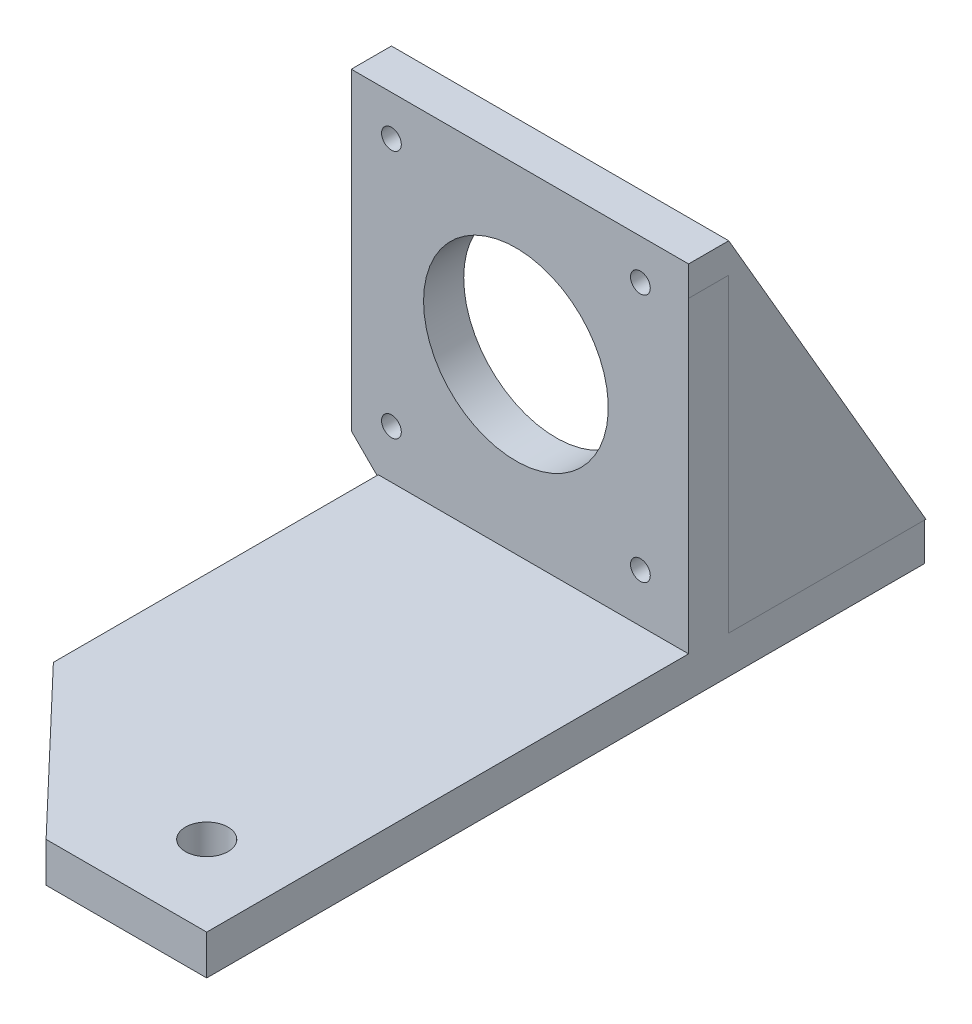
ISO-10303-21;
HEADER;
FILE_DESCRIPTION(('STEP AP214'),'2;1');
FILE_NAME('part.step','',(''),(''),'','','');
FILE_SCHEMA(('AUTOMOTIVE_DESIGN { 1 0 10303 214 1 1 1 1 }'));
ENDSEC;
DATA;
#1=APPLICATION_CONTEXT('core data for automotive mechanical design processes');
#2=APPLICATION_PROTOCOL_DEFINITION('international standard','automotive_design',2000,#1);
#3=PRODUCT_CONTEXT('',#1,'mechanical');
#4=PRODUCT('Part','Part','',(#3));
#5=PRODUCT_RELATED_PRODUCT_CATEGORY('part','',(#4));
#6=PRODUCT_DEFINITION_FORMATION('','',#4);
#7=PRODUCT_DEFINITION_CONTEXT('part definition',#1,'design');
#8=PRODUCT_DEFINITION('design','',#6,#7);
#9=PRODUCT_DEFINITION_SHAPE('','',#8);
#10=(LENGTH_UNIT() NAMED_UNIT(*) SI_UNIT(.MILLI.,.METRE.));
#11=(NAMED_UNIT(*) PLANE_ANGLE_UNIT() SI_UNIT($,.RADIAN.));
#12=(NAMED_UNIT(*) SI_UNIT($,.STERADIAN.) SOLID_ANGLE_UNIT());
#13=UNCERTAINTY_MEASURE_WITH_UNIT(LENGTH_MEASURE(1.E-05),#10,'distance_accuracy_value','');
#14=(GEOMETRIC_REPRESENTATION_CONTEXT(3) GLOBAL_UNCERTAINTY_ASSIGNED_CONTEXT((#13)) GLOBAL_UNIT_ASSIGNED_CONTEXT((#10,
#11,#12)) REPRESENTATION_CONTEXT('',''));
#15=CARTESIAN_POINT('',(0.,0.,0.));
#16=DIRECTION('',(0.,0.,1.));
#17=DIRECTION('',(1.,0.,0.));
#18=AXIS2_PLACEMENT_3D('',#15,#16,#17);
#19=CARTESIAN_POINT('',(148.500000052157,-128.194250021961,-39.4500000000031));
#20=DIRECTION('',(0.,0.,-1.));
#21=DIRECTION('',(0.,-1.,0.));
#22=AXIS2_PLACEMENT_3D('',#19,#20,#21);
#23=PLANE('',#22);
#24=CARTESIAN_POINT('',(133.000000052157,-143.694250021961,-39.4500000000037));
#25=DIRECTION('',(0.,0.,-1.));
#26=DIRECTION('',(-1.,0.,0.));
#27=AXIS2_PLACEMENT_3D('',#24,#25,#26);
#28=CIRCLE('',#27,1.23);
#29=CARTESIAN_POINT('',(134.230000052157,-143.694250021961,-39.4500000000037));
#30=VERTEX_POINT('',#29);
#31=EDGE_CURVE('E324',#30,#30,#28,.T.);
#32=ORIENTED_EDGE('',*,*,#31,.T.);
#33=EDGE_LOOP('',(#32));
#34=FACE_BOUND('',#33,.T.);
#35=CARTESIAN_POINT('',(133.000000052158,-112.694250021961,-39.4500000000036));
#36=DIRECTION('',(0.,0.,-1.));
#37=DIRECTION('',(-1.,0.,0.));
#38=AXIS2_PLACEMENT_3D('',#35,#36,#37);
#39=CIRCLE('',#38,1.23);
#40=CARTESIAN_POINT('',(134.230000052157,-112.694250021961,-39.4500000000035));
#41=VERTEX_POINT('',#40);
#42=EDGE_CURVE('E310',#41,#41,#39,.T.);
#43=ORIENTED_EDGE('',*,*,#42,.T.);
#44=EDGE_LOOP('',(#43));
#45=FACE_BOUND('',#44,.T.);
#46=CARTESIAN_POINT('',(164.000000052157,-143.694250021961,-39.4500000000027));
#47=DIRECTION('',(0.,0.,-1.));
#48=DIRECTION('',(-1.,0.,0.));
#49=AXIS2_PLACEMENT_3D('',#46,#47,#48);
#50=CIRCLE('',#49,1.23);
#51=CARTESIAN_POINT('',(165.230000052157,-143.694250021961,-39.4500000000027));
#52=VERTEX_POINT('',#51);
#53=EDGE_CURVE('E275',#52,#52,#50,.T.);
#54=ORIENTED_EDGE('',*,*,#53,.T.);
#55=EDGE_LOOP('',(#54));
#56=FACE_BOUND('',#55,.T.);
#57=CARTESIAN_POINT('',(164.000000052158,-112.694250021961,-39.4500000000026));
#58=DIRECTION('',(0.,0.,-1.));
#59=DIRECTION('',(-1.,0.,0.));
#60=AXIS2_PLACEMENT_3D('',#57,#58,#59);
#61=CIRCLE('',#60,1.23);
#62=CARTESIAN_POINT('',(165.230000052158,-112.694250021961,-39.4500000000025));
#63=VERTEX_POINT('',#62);
#64=EDGE_CURVE('E27',#63,#63,#61,.T.);
#65=ORIENTED_EDGE('',*,*,#64,.T.);
#66=EDGE_LOOP('',(#65));
#67=FACE_BOUND('',#66,.T.);
#68=CARTESIAN_POINT('',(148.500000052157,-128.194250021961,-39.4500000000031));
#69=DIRECTION('',(0.,0.,-1.));
#70=DIRECTION('',(1.,0.,0.));
#71=AXIS2_PLACEMENT_3D('',#68,#69,#70);
#72=CIRCLE('',#71,11.5);
#73=CARTESIAN_POINT('',(137.000000052157,-128.194250021961,-39.4500000000035));
#74=VERTEX_POINT('',#73);
#75=EDGE_CURVE('E355',#74,#74,#72,.T.);
#76=ORIENTED_EDGE('',*,*,#75,.T.);
#77=EDGE_LOOP('',(#76));
#78=FACE_BOUND('',#77,.T.);
#79=DIRECTION('',(1.,0.,0.));
#80=VECTOR('',#79,1.);
#81=CARTESIAN_POINT('',(159.250000052157,-149.744250021961,-39.4500000000029));
#82=LINE('',#81,#80);
#83=CARTESIAN_POINT('',(131.364748782072,-149.744250021961,-39.4500000000038));
#84=VERTEX_POINT('',#83);
#85=CARTESIAN_POINT('',(170.000000052158,-149.744250021961,-39.4500000000026));
#86=VERTEX_POINT('',#85);
#87=EDGE_CURVE('E400',#84,#86,#82,.T.);
#88=ORIENTED_EDGE('',*,*,#87,.T.);
#89=DIRECTION('',(0.,-1.,0.));
#90=VECTOR('',#89,1.);
#91=CARTESIAN_POINT('',(170.000000052157,-131.797822210261,-39.4500000000025));
#92=LINE('',#91,#90);
#93=CARTESIAN_POINT('',(170.000000052441,-111.40139439856,-39.4500000000023));
#94=VERTEX_POINT('',#93);
#95=EDGE_CURVE('E337',#94,#86,#92,.T.);
#96=ORIENTED_EDGE('',*,*,#95,.F.);
#97=DIRECTION('',(1.,0.,0.));
#98=VECTOR('',#97,1.);
#99=CARTESIAN_POINT('',(169.225256491919,-111.40139439856,-39.4500000000023));
#100=LINE('',#99,#98);
#101=CARTESIAN_POINT('',(170.000256491919,-111.40139439856,-39.4500000000023));
#102=VERTEX_POINT('',#101);
#103=EDGE_CURVE('E305',#94,#102,#100,.T.);
#104=ORIENTED_EDGE('',*,*,#103,.T.);
#105=DIRECTION('',(0.,-1.,0.));
#106=VECTOR('',#105,1.);
#107=CARTESIAN_POINT('',(170.000256491919,-118.928836768922,-39.4500000000024));
#108=LINE('',#107,#106);
#109=CARTESIAN_POINT('',(170.000256491919,-107.694249950324,-39.4500000000023));
#110=VERTEX_POINT('',#109);
#111=EDGE_CURVE('E304',#110,#102,#108,.T.);
#112=ORIENTED_EDGE('',*,*,#111,.F.);
#113=DIRECTION('',(1.,0.,0.));
#114=VECTOR('',#113,1.);
#115=CARTESIAN_POINT('',(131.529437303681,-107.694250021961,-39.4500000000036));
#116=LINE('',#115,#114);
#117=CARTESIAN_POINT('',(128.000000052069,-107.694249950324,-39.4500000000037));
#118=VERTEX_POINT('',#117);
#119=EDGE_CURVE('E11',#118,#110,#116,.T.);
#120=ORIENTED_EDGE('',*,*,#119,.F.);
#121=DIRECTION('',(0.,-1.,0.));
#122=VECTOR('',#121,1.);
#123=CARTESIAN_POINT('',(128.000000052157,-148.694250021961,-39.450000000004));
#124=LINE('',#123,#122);
#125=CARTESIAN_POINT('',(128.000000052157,-146.694250021961,-39.4500000000039));
#126=VERTEX_POINT('',#125);
#127=EDGE_CURVE('E232',#118,#126,#124,.T.);
#128=ORIENTED_EDGE('',*,*,#127,.T.);
#129=DIRECTION('',(-0.70710678117877,0.707106781194325,0.));
#130=VECTOR('',#129,1.);
#131=CARTESIAN_POINT('',(130.500000052001,-149.19425002186,-39.4500000000039));
#132=LINE('',#131,#130);
#133=CARTESIAN_POINT('',(131.364748782072,-150.05899875195,-39.4500000000038));
#134=VERTEX_POINT('',#133);
#135=EDGE_CURVE('E385',#134,#126,#132,.T.);
#136=ORIENTED_EDGE('',*,*,#135,.F.);
#137=DIRECTION('',(0.,1.,0.));
#138=VECTOR('',#137,1.);
#139=CARTESIAN_POINT('',(131.364748782072,-138.969250021961,-39.4500000000038));
#140=LINE('',#139,#138);
#141=EDGE_CURVE('E449',#134,#84,#140,.T.);
#142=ORIENTED_EDGE('',*,*,#141,.T.);
#143=EDGE_LOOP('',(#88,#96,#104,#112,#120,#128,#136,#142));
#144=FACE_BOUND('',#143,.T.);
#145=ADVANCED_FACE('F16',(#34,#45,#56,#67,#78,#144),#23,.F.);
#146=CARTESIAN_POINT('',(131.707144481147,-107.694250021961,-39.4500000000036));
#147=DIRECTION('',(0.,1.,0.));
#148=DIRECTION('',(0.,0.,-1.));
#149=AXIS2_PLACEMENT_3D('',#146,#147,#148);
#150=PLANE('',#149);
#151=ORIENTED_EDGE('',*,*,#119,.T.);
#152=DIRECTION('',(0.,0.,1.));
#153=VECTOR('',#152,1.);
#154=CARTESIAN_POINT('',(170.000256491919,-107.694249950324,-39.4500000000023));
#155=LINE('',#154,#153);
#156=CARTESIAN_POINT('',(170.000256491919,-107.694249950324,-44.4500000000023));
#157=VERTEX_POINT('',#156);
#158=EDGE_CURVE('E299',#157,#110,#155,.T.);
#159=ORIENTED_EDGE('',*,*,#158,.F.);
#160=DIRECTION('',(1.,0.,0.));
#161=VECTOR('',#160,1.);
#162=CARTESIAN_POINT('',(169.225256491919,-107.694249950324,-44.4500000000023));
#163=LINE('',#162,#161);
#164=CARTESIAN_POINT('',(166.000256491919,-107.694249950324,-44.4500000000024));
#165=VERTEX_POINT('',#164);
#166=EDGE_CURVE('E461',#165,#157,#163,.T.);
#167=ORIENTED_EDGE('',*,*,#166,.F.);
#168=DIRECTION('',(1.,0.,0.));
#169=VECTOR('',#168,1.);
#170=CARTESIAN_POINT('',(169.225256491919,-107.694249950324,-44.4500000000023));
#171=LINE('',#170,#169);
#172=CARTESIAN_POINT('',(128.00000005207,-107.694249950324,-44.4500000000037));
#173=VERTEX_POINT('',#172);
#174=EDGE_CURVE('E316',#173,#165,#171,.T.);
#175=ORIENTED_EDGE('',*,*,#174,.F.);
#176=DIRECTION('',(0.,0.,-1.));
#177=VECTOR('',#176,1.);
#178=CARTESIAN_POINT('',(128.000000052069,-107.694249950324,-39.4500000000037));
#179=LINE('',#178,#177);
#180=EDGE_CURVE('E527',#118,#173,#179,.T.);
#181=ORIENTED_EDGE('',*,*,#180,.F.);
#182=EDGE_LOOP('',(#151,#159,#167,#175,#181));
#183=FACE_BOUND('',#182,.T.);
#184=ADVANCED_FACE('F678',(#183),#150,.T.);
#185=CARTESIAN_POINT('',(164.000000052158,-112.694250021961,-39.4500000000026));
#186=DIRECTION('',(0.,0.,-1.));
#187=DIRECTION('',(-1.,0.,0.));
#188=AXIS2_PLACEMENT_3D('',#185,#186,#187);
#189=CYLINDRICAL_SURFACE('',#188,1.23);
#190=CARTESIAN_POINT('',(164.000000052158,-112.694250021961,-44.4500000000026));
#191=DIRECTION('',(0.,0.,1.));
#192=DIRECTION('',(-1.,0.,0.));
#193=AXIS2_PLACEMENT_3D('',#190,#191,#192);
#194=CIRCLE('',#193,1.23);
#195=CARTESIAN_POINT('',(165.230000052158,-112.694250021961,-44.4500000000025));
#196=VERTEX_POINT('',#195);
#197=EDGE_CURVE('E273',#196,#196,#194,.T.);
#198=ORIENTED_EDGE('',*,*,#197,.F.);
#199=DIRECTION('',(0.,0.,1.));
#200=VECTOR('',#199,1.);
#201=CARTESIAN_POINT('',(165.230000052158,-112.694250021961,-39.4500000000025));
#202=LINE('',#201,#200);
#203=EDGE_CURVE('E270',#196,#63,#202,.T.);
#204=ORIENTED_EDGE('',*,*,#203,.T.);
#205=ORIENTED_EDGE('',*,*,#64,.F.);
#206=ORIENTED_EDGE('',*,*,#203,.F.);
#207=EDGE_LOOP('',(#198,#204,#205,#206));
#208=FACE_BOUND('',#207,.T.);
#209=ADVANCED_FACE('F272',(#208),#189,.F.);
#210=CARTESIAN_POINT('',(164.000000052157,-143.694250021961,-39.4500000000027));
#211=DIRECTION('',(0.,0.,-1.));
#212=DIRECTION('',(-1.,0.,0.));
#213=AXIS2_PLACEMENT_3D('',#210,#211,#212);
#214=CYLINDRICAL_SURFACE('',#213,1.23);
#215=CARTESIAN_POINT('',(164.000000052157,-143.694250021961,-44.4500000000027));
#216=DIRECTION('',(0.,0.,1.));
#217=DIRECTION('',(-1.,0.,0.));
#218=AXIS2_PLACEMENT_3D('',#215,#216,#217);
#219=CIRCLE('',#218,1.23);
#220=CARTESIAN_POINT('',(165.230000052157,-143.694250021961,-44.4500000000027));
#221=VERTEX_POINT('',#220);
#222=EDGE_CURVE('E280',#221,#221,#219,.T.);
#223=ORIENTED_EDGE('',*,*,#222,.F.);
#224=DIRECTION('',(0.,0.,1.));
#225=VECTOR('',#224,1.);
#226=CARTESIAN_POINT('',(165.230000052157,-143.694250021961,-39.4500000000027));
#227=LINE('',#226,#225);
#228=EDGE_CURVE('E263',#221,#52,#227,.T.);
#229=ORIENTED_EDGE('',*,*,#228,.T.);
#230=ORIENTED_EDGE('',*,*,#53,.F.);
#231=ORIENTED_EDGE('',*,*,#228,.F.);
#232=EDGE_LOOP('',(#223,#229,#230,#231));
#233=FACE_BOUND('',#232,.T.);
#234=ADVANCED_FACE('F675',(#233),#214,.F.);
#235=CARTESIAN_POINT('',(133.000000052158,-112.694250021961,-39.4500000000036));
#236=DIRECTION('',(0.,0.,-1.));
#237=DIRECTION('',(-1.,0.,0.));
#238=AXIS2_PLACEMENT_3D('',#235,#236,#237);
#239=CYLINDRICAL_SURFACE('',#238,1.23);
#240=CARTESIAN_POINT('',(133.000000052158,-112.694250021961,-44.4500000000036));
#241=DIRECTION('',(0.,0.,1.));
#242=DIRECTION('',(-1.,0.,0.));
#243=AXIS2_PLACEMENT_3D('',#240,#241,#242);
#244=CIRCLE('',#243,1.23);
#245=CARTESIAN_POINT('',(134.230000052158,-112.694250021961,-44.4500000000035));
#246=VERTEX_POINT('',#245);
#247=EDGE_CURVE('E287',#246,#246,#244,.T.);
#248=ORIENTED_EDGE('',*,*,#247,.F.);
#249=DIRECTION('',(0.,0.,1.));
#250=VECTOR('',#249,1.);
#251=CARTESIAN_POINT('',(134.230000052157,-112.694250021961,-39.4500000000035));
#252=LINE('',#251,#250);
#253=EDGE_CURVE('E313',#246,#41,#252,.T.);
#254=ORIENTED_EDGE('',*,*,#253,.T.);
#255=ORIENTED_EDGE('',*,*,#42,.F.);
#256=ORIENTED_EDGE('',*,*,#253,.F.);
#257=EDGE_LOOP('',(#248,#254,#255,#256));
#258=FACE_BOUND('',#257,.T.);
#259=ADVANCED_FACE('F18',(#258),#239,.F.);
#260=CARTESIAN_POINT('',(133.000000052157,-143.694250021961,-39.4500000000037));
#261=DIRECTION('',(0.,0.,-1.));
#262=DIRECTION('',(-1.,0.,0.));
#263=AXIS2_PLACEMENT_3D('',#260,#261,#262);
#264=CYLINDRICAL_SURFACE('',#263,1.23);
#265=CARTESIAN_POINT('',(133.000000052157,-143.694250021961,-44.4500000000037));
#266=DIRECTION('',(0.,0.,1.));
#267=DIRECTION('',(-1.,0.,0.));
#268=AXIS2_PLACEMENT_3D('',#265,#266,#267);
#269=CIRCLE('',#268,1.23);
#270=CARTESIAN_POINT('',(134.230000052157,-143.694250021961,-44.4500000000037));
#271=VERTEX_POINT('',#270);
#272=EDGE_CURVE('E474',#271,#271,#269,.T.);
#273=ORIENTED_EDGE('',*,*,#272,.F.);
#274=DIRECTION('',(0.,0.,1.));
#275=VECTOR('',#274,1.);
#276=CARTESIAN_POINT('',(134.230000052157,-143.694250021961,-39.4500000000037));
#277=LINE('',#276,#275);
#278=EDGE_CURVE('E303',#271,#30,#277,.T.);
#279=ORIENTED_EDGE('',*,*,#278,.T.);
#280=ORIENTED_EDGE('',*,*,#31,.F.);
#281=ORIENTED_EDGE('',*,*,#278,.F.);
#282=EDGE_LOOP('',(#273,#279,#280,#281));
#283=FACE_BOUND('',#282,.T.);
#284=ADVANCED_FACE('F666',(#283),#264,.F.);
#285=CARTESIAN_POINT('',(170.000256491919,-107.694249950324,-39.4500000000023));
#286=DIRECTION('',(1.,0.,0.));
#287=DIRECTION('',(0.,0.,1.));
#288=AXIS2_PLACEMENT_3D('',#285,#286,#287);
#289=PLANE('',#288);
#290=ORIENTED_EDGE('',*,*,#111,.T.);
#291=DIRECTION('',(0.,0.,-1.));
#292=VECTOR('',#291,1.);
#293=CARTESIAN_POINT('',(170.000256491919,-111.40139439856,-41.9500000000023));
#294=LINE('',#293,#292);
#295=CARTESIAN_POINT('',(170.000256491919,-111.40139439856,-44.4500000000023));
#296=VERTEX_POINT('',#295);
#297=EDGE_CURVE('E309',#102,#296,#294,.T.);
#298=ORIENTED_EDGE('',*,*,#297,.T.);
#299=DIRECTION('',(0.,1.,0.));
#300=VECTOR('',#299,1.);
#301=CARTESIAN_POINT('',(170.000256491919,-150.000002235174,-44.4500000000023));
#302=LINE('',#301,#300);
#303=CARTESIAN_POINT('',(170.000256491919,-150.000002235174,-44.4500000000023));
#304=VERTEX_POINT('',#303);
#305=EDGE_CURVE('E345',#304,#296,#302,.T.);
#306=ORIENTED_EDGE('',*,*,#305,.F.);
#307=DIRECTION('',(0.,0.,1.));
#308=VECTOR('',#307,1.);
#309=CARTESIAN_POINT('',(170.00025649192,-150.000002235174,-69.0000013261975));
#310=LINE('',#309,#308);
#311=CARTESIAN_POINT('',(170.00025649192,-150.000002235174,-69.0000013261975));
#312=VERTEX_POINT('',#311);
#313=EDGE_CURVE('E429',#312,#304,#310,.T.);
#314=ORIENTED_EDGE('',*,*,#313,.F.);
#315=DIRECTION('',(0.,-0.864918791797365,-0.501911828507545));
#316=VECTOR('',#315,1.);
#317=CARTESIAN_POINT('',(170.000256491919,-107.694249950324,-44.4500000000023));
#318=LINE('',#317,#316);
#319=EDGE_CURVE('E456',#157,#312,#318,.T.);
#320=ORIENTED_EDGE('',*,*,#319,.F.);
#321=ORIENTED_EDGE('',*,*,#158,.T.);
#322=EDGE_LOOP('',(#290,#298,#306,#314,#320,#321));
#323=FACE_BOUND('',#322,.T.);
#324=ADVANCED_FACE('F637',(#323),#289,.T.);
#325=CARTESIAN_POINT('',(169.225256491919,-111.40139439856,-39.4500000000023));
#326=DIRECTION('',(0.,-1.,0.));
#327=DIRECTION('',(0.,0.,-1.));
#328=AXIS2_PLACEMENT_3D('',#325,#326,#327);
#329=PLANE('',#328);
#330=DIRECTION('',(0.,0.,1.));
#331=VECTOR('',#330,1.);
#332=CARTESIAN_POINT('',(170.000000052441,-111.40139439856,-39.4500000000023));
#333=LINE('',#332,#331);
#334=CARTESIAN_POINT('',(170.000000052441,-111.40139439856,-44.4500000000023));
#335=VERTEX_POINT('',#334);
#336=EDGE_CURVE('E341',#335,#94,#333,.T.);
#337=ORIENTED_EDGE('',*,*,#336,.F.);
#338=DIRECTION('',(1.,0.,0.));
#339=VECTOR('',#338,1.);
#340=CARTESIAN_POINT('',(169.225256491919,-111.40139439856,-44.4500000000023));
#341=LINE('',#340,#339);
#342=EDGE_CURVE('E298',#335,#296,#341,.T.);
#343=ORIENTED_EDGE('',*,*,#342,.T.);
#344=ORIENTED_EDGE('',*,*,#297,.F.);
#345=ORIENTED_EDGE('',*,*,#103,.F.);
#346=EDGE_LOOP('',(#337,#343,#344,#345));
#347=FACE_BOUND('',#346,.T.);
#348=ADVANCED_FACE('F632',(#347),#329,.T.);
#349=CARTESIAN_POINT('',(160.000000052158,-149.694250021961,-54.4500000000026));
#350=DIRECTION('',(0.,-1.,0.));
#351=DIRECTION('',(-1.,0.,0.));
#352=AXIS2_PLACEMENT_3D('',#349,#350,#351);
#353=CYLINDRICAL_SURFACE('',#352,2.65);
#354=CARTESIAN_POINT('',(160.000000052158,-149.894250021961,-54.4500000000026));
#355=DIRECTION('',(0.,1.,0.));
#356=DIRECTION('',(-1.,0.,0.));
#357=AXIS2_PLACEMENT_3D('',#354,#355,#356);
#358=CIRCLE('',#357,2.65);
#359=CARTESIAN_POINT('',(162.650000052158,-149.894250021961,-54.4500000000026));
#360=VERTEX_POINT('',#359);
#361=EDGE_CURVE('E325',#360,#360,#358,.T.);
#362=ORIENTED_EDGE('',*,*,#361,.T.);
#363=DIRECTION('',(0.,-1.,0.));
#364=VECTOR('',#363,1.);
#365=CARTESIAN_POINT('',(162.650000052158,-149.694250021961,-54.4500000000026));
#366=LINE('',#365,#364);
#367=CARTESIAN_POINT('',(162.650000052158,-154.694250021961,-54.4500000000026));
#368=VERTEX_POINT('',#367);
#369=EDGE_CURVE('E426',#360,#368,#366,.T.);
#370=ORIENTED_EDGE('',*,*,#369,.T.);
#371=CARTESIAN_POINT('',(160.000000052158,-154.694250021961,-54.4500000000026));
#372=DIRECTION('',(0.,1.,0.));
#373=DIRECTION('',(-1.,0.,0.));
#374=AXIS2_PLACEMENT_3D('',#371,#372,#373);
#375=CIRCLE('',#374,2.65);
#376=EDGE_CURVE('E482',#368,#368,#375,.T.);
#377=ORIENTED_EDGE('',*,*,#376,.F.);
#378=ORIENTED_EDGE('',*,*,#369,.F.);
#379=EDGE_LOOP('',(#362,#370,#377,#378));
#380=FACE_BOUND('',#379,.T.);
#381=ADVANCED_FACE('F897',(#380),#353,.F.);
#382=CARTESIAN_POINT('',(170.00025649192,-150.000002235174,-69.0000013261975));
#383=DIRECTION('',(0.,-1.,0.));
#384=DIRECTION('',(0.,0.,-1.));
#385=AXIS2_PLACEMENT_3D('',#382,#383,#384);
#386=PLANE('',#385);
#387=DIRECTION('',(0.,0.,1.));
#388=VECTOR('',#387,1.);
#389=CARTESIAN_POINT('',(170.000000052441,-150.000002235174,-54.2250006631001));
#390=LINE('',#389,#388);
#391=CARTESIAN_POINT('',(170.000000052442,-150.000002235174,-69.0000013261975));
#392=VERTEX_POINT('',#391);
#393=CARTESIAN_POINT('',(170.000000052442,-150.000002235174,-68.8225735100148));
#394=VERTEX_POINT('',#393);
#395=EDGE_CURVE('E331',#392,#394,#390,.T.);
#396=ORIENTED_EDGE('',*,*,#395,.F.);
#397=DIRECTION('',(-1.,0.,0.));
#398=VECTOR('',#397,1.);
#399=CARTESIAN_POINT('',(170.00025649192,-150.000002235174,-69.0000013261975));
#400=LINE('',#399,#398);
#401=EDGE_CURVE('E460',#312,#392,#400,.T.);
#402=ORIENTED_EDGE('',*,*,#401,.F.);
#403=ORIENTED_EDGE('',*,*,#313,.T.);
#404=DIRECTION('',(-1.,0.,0.));
#405=VECTOR('',#404,1.);
#406=CARTESIAN_POINT('',(170.000256491919,-150.000002235174,-44.4500000000023));
#407=LINE('',#406,#405);
#408=CARTESIAN_POINT('',(170.000000052441,-150.000002235174,-44.4500000000023));
#409=VERTEX_POINT('',#408);
#410=EDGE_CURVE('E342',#304,#409,#407,.T.);
#411=ORIENTED_EDGE('',*,*,#410,.T.);
#412=DIRECTION('',(0.,0.,1.));
#413=VECTOR('',#412,1.);
#414=CARTESIAN_POINT('',(170.000000052441,-150.000002235174,-54.2250006631001));
#415=LINE('',#414,#413);
#416=EDGE_CURVE('E450',#394,#409,#415,.T.);
#417=ORIENTED_EDGE('',*,*,#416,.F.);
#418=EDGE_LOOP('',(#396,#402,#403,#411,#417));
#419=FACE_BOUND('',#418,.T.);
#420=ADVANCED_FACE('F650',(#419),#386,.T.);
#421=CARTESIAN_POINT('',(170.000256491919,-107.694249950324,-44.4500000000023));
#422=DIRECTION('',(0.,0.501911828507545,-0.864918791797365));
#423=DIRECTION('',(-1.,0.,0.));
#424=AXIS2_PLACEMENT_3D('',#421,#422,#423);
#425=PLANE('',#424);
#426=DIRECTION('',(1.,0.,0.));
#427=VECTOR('',#426,1.);
#428=CARTESIAN_POINT('',(149.000128271951,-149.694250021961,-68.8225735100156));
#429=LINE('',#428,#427);
#430=CARTESIAN_POINT('',(166.00025649192,-149.694250021961,-68.822573510015));
#431=VERTEX_POINT('',#430);
#432=CARTESIAN_POINT('',(170.000000052158,-149.694250021961,-68.8225735100148));
#433=VERTEX_POINT('',#432);
#434=EDGE_CURVE('E502',#431,#433,#429,.T.);
#435=ORIENTED_EDGE('',*,*,#434,.F.);
#436=DIRECTION('',(0.,-0.864918791797365,-0.501911828507545));
#437=VECTOR('',#436,1.);
#438=CARTESIAN_POINT('',(166.000256491919,-107.694249950324,-44.4500000000024));
#439=LINE('',#438,#437);
#440=EDGE_CURVE('E295',#165,#431,#439,.T.);
#441=ORIENTED_EDGE('',*,*,#440,.F.);
#442=ORIENTED_EDGE('',*,*,#166,.T.);
#443=ORIENTED_EDGE('',*,*,#319,.T.);
#444=ORIENTED_EDGE('',*,*,#401,.T.);
#445=DIRECTION('',(0.,-0.864918791797365,-0.501911828507545));
#446=VECTOR('',#445,1.);
#447=CARTESIAN_POINT('',(170.000000052441,-107.99559620047,-44.6248710386004));
#448=LINE('',#447,#446);
#449=EDGE_CURVE('E336',#433,#392,#448,.T.);
#450=ORIENTED_EDGE('',*,*,#449,.F.);
#451=EDGE_LOOP('',(#435,#441,#442,#443,#444,#450));
#452=FACE_BOUND('',#451,.T.);
#453=ADVANCED_FACE('F916',(#452),#425,.T.);
#454=CARTESIAN_POINT('',(170.000256491919,-150.000002235174,-44.4500000000023));
#455=DIRECTION('',(0.,0.,1.));
#456=DIRECTION('',(1.,0.,0.));
#457=AXIS2_PLACEMENT_3D('',#454,#455,#456);
#458=PLANE('',#457);
#459=ORIENTED_EDGE('',*,*,#342,.F.);
#460=DIRECTION('',(0.,1.,0.));
#461=VECTOR('',#460,1.);
#462=CARTESIAN_POINT('',(170.000000052441,-130.700698316867,-44.4500000000023));
#463=LINE('',#462,#461);
#464=EDGE_CURVE('E454',#409,#335,#463,.T.);
#465=ORIENTED_EDGE('',*,*,#464,.F.);
#466=ORIENTED_EDGE('',*,*,#410,.F.);
#467=ORIENTED_EDGE('',*,*,#305,.T.);
#468=EDGE_LOOP('',(#459,#465,#466,#467));
#469=FACE_BOUND('',#468,.T.);
#470=ADVANCED_FACE('F643',(#469),#458,.T.);
#471=CARTESIAN_POINT('',(166.00025649192,-128.847126092749,-56.7250006631));
#472=DIRECTION('',(-1.,0.,0.));
#473=DIRECTION('',(0.,0.,1.));
#474=AXIS2_PLACEMENT_3D('',#471,#472,#473);
#475=PLANE('',#474);
#476=DIRECTION('',(0.,-1.,0.));
#477=VECTOR('',#476,1.);
#478=CARTESIAN_POINT('',(166.000256491919,-149.694250021961,-44.4500000000024));
#479=LINE('',#478,#477);
#480=CARTESIAN_POINT('',(166.000256491919,-149.894250021961,-44.4500000000024));
#481=VERTEX_POINT('',#480);
#482=EDGE_CURVE('E318',#165,#481,#479,.T.);
#483=ORIENTED_EDGE('',*,*,#482,.F.);
#484=ORIENTED_EDGE('',*,*,#440,.T.);
#485=DIRECTION('',(0.,-1.,0.));
#486=VECTOR('',#485,1.);
#487=CARTESIAN_POINT('',(166.00025649192,-149.694250021961,-68.822573510015));
#488=LINE('',#487,#486);
#489=CARTESIAN_POINT('',(166.00025649192,-149.894250021961,-68.822573510015));
#490=VERTEX_POINT('',#489);
#491=EDGE_CURVE('E414',#431,#490,#488,.T.);
#492=ORIENTED_EDGE('',*,*,#491,.T.);
#493=DIRECTION('',(0.,0.,1.));
#494=VECTOR('',#493,1.);
#495=CARTESIAN_POINT('',(166.000256491918,-149.894250021961,-16.5875003315514));
#496=LINE('',#495,#494);
#497=EDGE_CURVE('E330',#490,#481,#496,.T.);
#498=ORIENTED_EDGE('',*,*,#497,.T.);
#499=EDGE_LOOP('',(#483,#484,#492,#498));
#500=FACE_BOUND('',#499,.T.);
#501=ADVANCED_FACE('F911',(#500),#475,.T.);
#502=CARTESIAN_POINT('',(148.500000052158,-128.194250021961,-44.4500000000031));
#503=DIRECTION('',(0.,0.,1.));
#504=DIRECTION('',(1.,0.,0.));
#505=AXIS2_PLACEMENT_3D('',#502,#503,#504);
#506=CYLINDRICAL_SURFACE('',#505,11.5);
#507=ORIENTED_EDGE('',*,*,#75,.F.);
#508=DIRECTION('',(0.,0.,-1.));
#509=VECTOR('',#508,1.);
#510=CARTESIAN_POINT('',(137.000000052158,-128.194250021961,-44.4500000000035));
#511=LINE('',#510,#509);
#512=CARTESIAN_POINT('',(137.000000052158,-128.194250021961,-44.4500000000035));
#513=VERTEX_POINT('',#512);
#514=EDGE_CURVE('E293',#74,#513,#511,.T.);
#515=ORIENTED_EDGE('',*,*,#514,.T.);
#516=CARTESIAN_POINT('',(148.500000052158,-128.194250021961,-44.4500000000031));
#517=DIRECTION('',(0.,0.,1.));
#518=DIRECTION('',(1.,0.,0.));
#519=AXIS2_PLACEMENT_3D('',#516,#517,#518);
#520=CIRCLE('',#519,11.5);
#521=EDGE_CURVE('E492',#513,#513,#520,.T.);
#522=ORIENTED_EDGE('',*,*,#521,.F.);
#523=ORIENTED_EDGE('',*,*,#514,.F.);
#524=EDGE_LOOP('',(#507,#515,#522,#523));
#525=FACE_BOUND('',#524,.T.);
#526=ADVANCED_FACE('F685',(#525),#506,.F.);
#527=CARTESIAN_POINT('',(151.500001173424,-140.694250021961,-53.7250006184001));
#528=DIRECTION('',(0.,1.,0.));
#529=DIRECTION('',(0.,0.,-1.));
#530=AXIS2_PLACEMENT_3D('',#527,#528,#529);
#531=PLANE('',#530);
#532=DIRECTION('',(0.,0.,1.));
#533=VECTOR('',#532,1.);
#534=CARTESIAN_POINT('',(150.00000005207,-140.694250021961,-74.862500309202));
#535=LINE('',#534,#533);
#536=CARTESIAN_POINT('',(150.00000005207,-140.694250021961,-45.000001236797));
#537=VERTEX_POINT('',#536);
#538=CARTESIAN_POINT('',(150.00000005207,-140.694250021961,-44.4500000000032));
#539=VERTEX_POINT('',#538);
#540=EDGE_CURVE('E395',#537,#539,#535,.T.);
#541=ORIENTED_EDGE('',*,*,#540,.T.);
#542=DIRECTION('',(-1.,0.,0.));
#543=VECTOR('',#542,1.);
#544=CARTESIAN_POINT('',(150.000000612791,-140.694250021961,-44.4500000000032));
#545=LINE('',#544,#543);
#546=CARTESIAN_POINT('',(154.000002294779,-140.694250021961,-44.4500000000032));
#547=VERTEX_POINT('',#546);
#548=EDGE_CURVE('E185',#547,#539,#545,.T.);
#549=ORIENTED_EDGE('',*,*,#548,.F.);
#550=DIRECTION('',(0.,0.,-1.));
#551=VECTOR('',#550,1.);
#552=CARTESIAN_POINT('',(154.000002294779,-140.694250021961,-44.4500000000032));
#553=LINE('',#552,#551);
#554=CARTESIAN_POINT('',(154.000002294779,-140.694250021961,-45.000001236797));
#555=VERTEX_POINT('',#554);
#556=EDGE_CURVE('E359',#547,#555,#553,.T.);
#557=ORIENTED_EDGE('',*,*,#556,.T.);
#558=DIRECTION('',(1.,0.,0.));
#559=VECTOR('',#558,1.);
#560=CARTESIAN_POINT('',(152.750001734102,-140.694250021961,-45.000001236797));
#561=LINE('',#560,#559);
#562=EDGE_CURVE('E195',#537,#555,#561,.T.);
#563=ORIENTED_EDGE('',*,*,#562,.F.);
#564=EDGE_LOOP('',(#541,#549,#557,#563));
#565=FACE_BOUND('',#564,.T.);
#566=ADVANCED_FACE('F930',(#565),#531,.T.);
#567=CARTESIAN_POINT('',(154.000002294779,-149.694250021961,-44.4500000000033));
#568=DIRECTION('',(1.,0.,0.));
#569=DIRECTION('',(0.,0.,-1.));
#570=AXIS2_PLACEMENT_3D('',#567,#568,#569);
#571=PLANE('',#570);
#572=DIRECTION('',(0.,-0.707106781186544,-0.707106781186551));
#573=VECTOR('',#572,1.);
#574=CARTESIAN_POINT('',(154.000002294779,-144.806749712763,-49.1125009275985));
#575=LINE('',#574,#573);
#576=CARTESIAN_POINT('',(154.000002294779,-148.694250021961,-53.000001236797));
#577=VERTEX_POINT('',#576);
#578=EDGE_CURVE('E374',#555,#577,#575,.T.);
#579=ORIENTED_EDGE('',*,*,#578,.F.);
#580=ORIENTED_EDGE('',*,*,#556,.F.);
#581=DIRECTION('',(0.,1.,0.));
#582=VECTOR('',#581,1.);
#583=CARTESIAN_POINT('',(154.000002294779,-138.944250021961,-44.450000000003));
#584=LINE('',#583,#582);
#585=CARTESIAN_POINT('',(154.000002294779,-149.894250021961,-44.4500000000033));
#586=VERTEX_POINT('',#585);
#587=EDGE_CURVE('E289',#586,#547,#584,.T.);
#588=ORIENTED_EDGE('',*,*,#587,.F.);
#589=DIRECTION('',(0.,0.,-1.));
#590=VECTOR('',#589,1.);
#591=CARTESIAN_POINT('',(154.000002294779,-149.894250021961,-10.4500000000036));
#592=LINE('',#591,#590);
#593=CARTESIAN_POINT('',(154.000002294779,-149.894250021961,-53.000001236797));
#594=VERTEX_POINT('',#593);
#595=EDGE_CURVE('E380',#586,#594,#592,.T.);
#596=ORIENTED_EDGE('',*,*,#595,.T.);
#597=DIRECTION('',(0.,1.,0.));
#598=VECTOR('',#597,1.);
#599=CARTESIAN_POINT('',(154.000002294779,-149.694250021961,-53.000001236797));
#600=LINE('',#599,#598);
#601=EDGE_CURVE('E375',#594,#577,#600,.T.);
#602=ORIENTED_EDGE('',*,*,#601,.T.);
#603=EDGE_LOOP('',(#579,#580,#588,#596,#602));
#604=FACE_BOUND('',#603,.T.);
#605=ADVANCED_FACE('F943',(#604),#571,.T.);
#606=CARTESIAN_POINT('',(152.750001734102,-144.694250021961,-49.000001236797));
#607=DIRECTION('',(0.,0.707106781186551,-0.707106781186544));
#608=DIRECTION('',(-1.,0.,0.));
#609=AXIS2_PLACEMENT_3D('',#606,#607,#608);
#610=PLANE('',#609);
#611=DIRECTION('',(0.,0.707106781186544,0.707106781186551));
#612=VECTOR('',#611,1.);
#613=CARTESIAN_POINT('',(150.00000005207,-157.694249712763,-62.0000009275988));
#614=LINE('',#613,#612);
#615=CARTESIAN_POINT('',(150.00000005207,-148.694250021961,-53.000001236797));
#616=VERTEX_POINT('',#615);
#617=EDGE_CURVE('E398',#616,#537,#614,.T.);
#618=ORIENTED_EDGE('',*,*,#617,.T.);
#619=ORIENTED_EDGE('',*,*,#562,.T.);
#620=ORIENTED_EDGE('',*,*,#578,.T.);
#621=DIRECTION('',(-1.,0.,0.));
#622=VECTOR('',#621,1.);
#623=CARTESIAN_POINT('',(152.750001734102,-148.694250021961,-53.000001236797));
#624=LINE('',#623,#622);
#625=EDGE_CURVE('E418',#577,#616,#624,.T.);
#626=ORIENTED_EDGE('',*,*,#625,.T.);
#627=EDGE_LOOP('',(#618,#619,#620,#626));
#628=FACE_BOUND('',#627,.T.);
#629=ADVANCED_FACE('F940',(#628),#610,.T.);
#630=CARTESIAN_POINT('',(154.000002294779,-149.694250021961,-53.000001236797));
#631=DIRECTION('',(0.,0.,1.));
#632=DIRECTION('',(0.,-1.,0.));
#633=AXIS2_PLACEMENT_3D('',#630,#631,#632);
#634=PLANE('',#633);
#635=DIRECTION('',(0.,1.,0.));
#636=VECTOR('',#635,1.);
#637=CARTESIAN_POINT('',(150.00000005207,-149.694250021961,-53.000001236797));
#638=LINE('',#637,#636);
#639=CARTESIAN_POINT('',(150.00000005207,-149.894250021961,-53.000001236797));
#640=VERTEX_POINT('',#639);
#641=EDGE_CURVE('E410',#640,#616,#638,.T.);
#642=ORIENTED_EDGE('',*,*,#641,.T.);
#643=ORIENTED_EDGE('',*,*,#625,.F.);
#644=ORIENTED_EDGE('',*,*,#601,.F.);
#645=DIRECTION('',(-1.,0.,0.));
#646=VECTOR('',#645,1.);
#647=CARTESIAN_POINT('',(141.000001173379,-149.894250021961,-53.000001236797));
#648=LINE('',#647,#646);
#649=EDGE_CURVE('E20',#594,#640,#648,.T.);
#650=ORIENTED_EDGE('',*,*,#649,.T.);
#651=EDGE_LOOP('',(#642,#643,#644,#650));
#652=FACE_BOUND('',#651,.T.);
#653=ADVANCED_FACE('F939',(#652),#634,.F.);
#654=CARTESIAN_POINT('',(128.000000052157,-144.987105592628,-39.4500000000039));
#655=DIRECTION('',(-1.,0.,0.));
#656=DIRECTION('',(0.,0.,1.));
#657=AXIS2_PLACEMENT_3D('',#654,#655,#656);
#658=PLANE('',#657);
#659=DIRECTION('',(0.,0.,-1.));
#660=VECTOR('',#659,1.);
#661=CARTESIAN_POINT('',(128.000000052157,-146.694250021961,-39.4500000000039));
#662=LINE('',#661,#660);
#663=CARTESIAN_POINT('',(128.000000052157,-146.694250021961,-44.4500000000033));
#664=VERTEX_POINT('',#663);
#665=EDGE_CURVE('E381',#126,#664,#662,.T.);
#666=ORIENTED_EDGE('',*,*,#665,.F.);
#667=ORIENTED_EDGE('',*,*,#127,.F.);
#668=ORIENTED_EDGE('',*,*,#180,.T.);
#669=DIRECTION('',(0.,-1.,0.));
#670=VECTOR('',#669,1.);
#671=CARTESIAN_POINT('',(128.000000052157,-147.340677807294,-44.4500000000033));
#672=LINE('',#671,#670);
#673=EDGE_CURVE('E222',#173,#664,#672,.T.);
#674=ORIENTED_EDGE('',*,*,#673,.T.);
#675=EDGE_LOOP('',(#666,#667,#668,#674));
#676=FACE_BOUND('',#675,.T.);
#677=ADVANCED_FACE('F670',(#676),#658,.T.);
#678=CARTESIAN_POINT('',(148.500000052158,-128.194250021961,-44.4500000000031));
#679=DIRECTION('',(0.,0.,-1.));
#680=DIRECTION('',(0.,-1.,0.));
#681=AXIS2_PLACEMENT_3D('',#678,#679,#680);
#682=PLANE('',#681);
#683=ORIENTED_EDGE('',*,*,#521,.T.);
#684=EDGE_LOOP('',(#683));
#685=FACE_BOUND('',#684,.T.);
#686=ORIENTED_EDGE('',*,*,#272,.T.);
#687=EDGE_LOOP('',(#686));
#688=FACE_BOUND('',#687,.T.);
#689=ORIENTED_EDGE('',*,*,#247,.T.);
#690=EDGE_LOOP('',(#689));
#691=FACE_BOUND('',#690,.T.);
#692=ORIENTED_EDGE('',*,*,#222,.T.);
#693=EDGE_LOOP('',(#692));
#694=FACE_BOUND('',#693,.T.);
#695=ORIENTED_EDGE('',*,*,#197,.T.);
#696=EDGE_LOOP('',(#695));
#697=FACE_BOUND('',#696,.T.);
#698=DIRECTION('',(0.70710678117877,-0.707106781194325,0.));
#699=VECTOR('',#698,1.);
#700=CARTESIAN_POINT('',(130.500000052001,-149.19425002186,-44.4500000000039));
#701=LINE('',#700,#699);
#702=CARTESIAN_POINT('',(136.000000051981,-154.694250021961,-44.4500000000033));
#703=VERTEX_POINT('',#702);
#704=EDGE_CURVE('E317',#664,#703,#701,.T.);
#705=ORIENTED_EDGE('',*,*,#704,.F.);
#706=ORIENTED_EDGE('',*,*,#673,.F.);
#707=ORIENTED_EDGE('',*,*,#174,.T.);
#708=ORIENTED_EDGE('',*,*,#482,.T.);
#709=DIRECTION('',(-1.,0.,0.));
#710=VECTOR('',#709,1.);
#711=CARTESIAN_POINT('',(138.25000005207,-149.894250021961,-44.4500000000036));
#712=LINE('',#711,#710);
#713=EDGE_CURVE('E376',#481,#586,#712,.T.);
#714=ORIENTED_EDGE('',*,*,#713,.T.);
#715=ORIENTED_EDGE('',*,*,#587,.T.);
#716=ORIENTED_EDGE('',*,*,#548,.T.);
#717=DIRECTION('',(0.,-1.,0.));
#718=VECTOR('',#717,1.);
#719=CARTESIAN_POINT('',(150.00000005207,-149.694250021961,-44.4500000000033));
#720=LINE('',#719,#718);
#721=CARTESIAN_POINT('',(150.00000005207,-154.694250021961,-44.4500000000033));
#722=VERTEX_POINT('',#721);
#723=EDGE_CURVE('E399',#539,#722,#720,.T.);
#724=ORIENTED_EDGE('',*,*,#723,.T.);
#725=DIRECTION('',(1.,0.,0.));
#726=VECTOR('',#725,1.);
#727=CARTESIAN_POINT('',(157.146427837619,-154.694250021961,-44.4500000000033));
#728=LINE('',#727,#726);
#729=EDGE_CURVE('E409',#703,#722,#728,.T.);
#730=ORIENTED_EDGE('',*,*,#729,.F.);
#731=EDGE_LOOP('',(#705,#706,#707,#708,#714,#715,#716,#724,#730));
#732=FACE_BOUND('',#731,.T.);
#733=ADVANCED_FACE('F278',(#685,#688,#691,#694,#697,#732),#682,.T.);
#734=CARTESIAN_POINT('',(132.000000052069,-150.694250021961,-39.4500000000038));
#735=DIRECTION('',(-0.707106781194325,-0.70710678117877,0.));
#736=DIRECTION('',(-0.70710678117877,0.707106781194325,0.));
#737=AXIS2_PLACEMENT_3D('',#734,#735,#736);
#738=PLANE('',#737);
#739=DIRECTION('',(-0.567976088385915,0.567976088398431,-0.595656214631773));
#740=VECTOR('',#739,1.);
#741=CARTESIAN_POINT('',(124.675308274701,-143.369558244433,-6.00888222996313));
#742=LINE('',#741,#740);
#743=CARTESIAN_POINT('',(136.00000005198,-154.694250021962,5.86771464420362));
#744=VERTEX_POINT('',#743);
#745=CARTESIAN_POINT('',(131.364748782071,-150.05899875195,1.00656594136385));
#746=VERTEX_POINT('',#745);
#747=EDGE_CURVE('E346',#744,#746,#742,.T.);
#748=ORIENTED_EDGE('',*,*,#747,.T.);
#749=DIRECTION('',(0.,0.,1.));
#750=VECTOR('',#749,1.);
#751=CARTESIAN_POINT('',(131.364748782072,-150.05899875195,-39.4500000000038));
#752=LINE('',#751,#750);
#753=EDGE_CURVE('E444',#134,#746,#752,.T.);
#754=ORIENTED_EDGE('',*,*,#753,.F.);
#755=ORIENTED_EDGE('',*,*,#135,.T.);
#756=ORIENTED_EDGE('',*,*,#665,.T.);
#757=ORIENTED_EDGE('',*,*,#704,.T.);
#758=DIRECTION('',(0.,0.,1.));
#759=VECTOR('',#758,1.);
#760=CARTESIAN_POINT('',(136.000000051981,-154.694250021961,-39.4500000000037));
#761=LINE('',#760,#759);
#762=EDGE_CURVE('E406',#703,#744,#761,.T.);
#763=ORIENTED_EDGE('',*,*,#762,.T.);
#764=EDGE_LOOP('',(#748,#754,#755,#756,#757,#763));
#765=FACE_BOUND('',#764,.T.);
#766=ADVANCED_FACE('F613',(#765),#738,.T.);
#767=CARTESIAN_POINT('',(170.000000052158,-149.694250021961,-68.8225735100148));
#768=DIRECTION('',(0.,0.,1.));
#769=DIRECTION('',(1.,0.,0.));
#770=AXIS2_PLACEMENT_3D('',#767,#768,#769);
#771=PLANE('',#770);
#772=ORIENTED_EDGE('',*,*,#434,.T.);
#773=DIRECTION('',(0.,-1.,0.));
#774=VECTOR('',#773,1.);
#775=CARTESIAN_POINT('',(170.000000052158,-149.694250021961,-68.8225735100148));
#776=LINE('',#775,#774);
#777=EDGE_CURVE('E335',#433,#394,#776,.T.);
#778=ORIENTED_EDGE('',*,*,#777,.T.);
#779=DIRECTION('',(0.,1.,0.));
#780=VECTOR('',#779,1.);
#781=CARTESIAN_POINT('',(170.000000052442,-130.647822210261,-68.8225735100147));
#782=LINE('',#781,#780);
#783=CARTESIAN_POINT('',(170.000000052158,-154.694250021961,-68.8225735100148));
#784=VERTEX_POINT('',#783);
#785=EDGE_CURVE('E455',#784,#394,#782,.T.);
#786=ORIENTED_EDGE('',*,*,#785,.F.);
#787=DIRECTION('',(1.,0.,0.));
#788=VECTOR('',#787,1.);
#789=CARTESIAN_POINT('',(167.646427837663,-154.694250021961,-68.8225735100148));
#790=LINE('',#789,#788);
#791=CARTESIAN_POINT('',(150.00000005207,-154.694250021961,-68.8225735100148));
#792=VERTEX_POINT('',#791);
#793=EDGE_CURVE('E437',#792,#784,#790,.T.);
#794=ORIENTED_EDGE('',*,*,#793,.F.);
#795=DIRECTION('',(0.,-1.,0.));
#796=VECTOR('',#795,1.);
#797=CARTESIAN_POINT('',(150.00000005207,-149.794250021961,-68.8225735100148));
#798=LINE('',#797,#796);
#799=CARTESIAN_POINT('',(150.00000005207,-149.894250021961,-68.8225735100148));
#800=VERTEX_POINT('',#799);
#801=EDGE_CURVE('E329',#800,#792,#798,.T.);
#802=ORIENTED_EDGE('',*,*,#801,.F.);
#803=DIRECTION('',(-1.,0.,0.));
#804=VECTOR('',#803,1.);
#805=CARTESIAN_POINT('',(149.000000052069,-149.894250021961,-68.8225735100148));
#806=LINE('',#805,#804);
#807=EDGE_CURVE('E363',#490,#800,#806,.T.);
#808=ORIENTED_EDGE('',*,*,#807,.F.);
#809=ORIENTED_EDGE('',*,*,#491,.F.);
#810=EDGE_LOOP('',(#772,#778,#786,#794,#802,#808,#809));
#811=FACE_BOUND('',#810,.T.);
#812=ADVANCED_FACE('F594',(#811),#771,.F.);
#813=CARTESIAN_POINT('',(170.000000052159,-149.694250021961,-96.0000000000025));
#814=DIRECTION('',(1.,0.,0.));
#815=DIRECTION('',(0.,0.,1.));
#816=AXIS2_PLACEMENT_3D('',#813,#814,#815);
#817=PLANE('',#816);
#818=ORIENTED_EDGE('',*,*,#449,.T.);
#819=ORIENTED_EDGE('',*,*,#395,.T.);
#820=ORIENTED_EDGE('',*,*,#777,.F.);
#821=EDGE_LOOP('',(#818,#819,#820));
#822=FACE_BOUND('',#821,.T.);
#823=ADVANCED_FACE('F918',(#822),#817,.F.);
#824=CARTESIAN_POINT('',(170.000000052441,-111.40139439856,-39.4500000000023));
#825=DIRECTION('',(1.,0.,0.));
#826=DIRECTION('',(0.,0.,1.));
#827=AXIS2_PLACEMENT_3D('',#824,#825,#826);
#828=PLANE('',#827);
#829=ORIENTED_EDGE('',*,*,#785,.T.);
#830=ORIENTED_EDGE('',*,*,#416,.T.);
#831=ORIENTED_EDGE('',*,*,#464,.T.);
#832=ORIENTED_EDGE('',*,*,#336,.T.);
#833=ORIENTED_EDGE('',*,*,#95,.T.);
#834=DIRECTION('',(0.,0.,1.));
#835=VECTOR('',#834,1.);
#836=CARTESIAN_POINT('',(170.000000052158,-149.744250021961,-39.4500000000026));
#837=LINE('',#836,#835);
#838=CARTESIAN_POINT('',(170.000000052156,-149.744250021962,20.5499999999974));
#839=VERTEX_POINT('',#838);
#840=EDGE_CURVE('E405',#86,#839,#837,.T.);
#841=ORIENTED_EDGE('',*,*,#840,.T.);
#842=DIRECTION('',(0.,1.,0.));
#843=VECTOR('',#842,1.);
#844=CARTESIAN_POINT('',(170.000000052156,-149.744250021962,20.5499999999974));
#845=LINE('',#844,#843);
#846=CARTESIAN_POINT('',(170.000000052156,-154.694250021962,20.5499999999974));
#847=VERTEX_POINT('',#846);
#848=EDGE_CURVE('E423',#847,#839,#845,.T.);
#849=ORIENTED_EDGE('',*,*,#848,.F.);
#850=DIRECTION('',(0.,0.,1.));
#851=VECTOR('',#850,1.);
#852=CARTESIAN_POINT('',(170.000000052158,-154.694250021961,-39.4500000000026));
#853=LINE('',#852,#851);
#854=EDGE_CURVE('E470',#784,#847,#853,.T.);
#855=ORIENTED_EDGE('',*,*,#854,.F.);
#856=EDGE_LOOP('',(#829,#830,#831,#832,#833,#841,#849,#855));
#857=FACE_BOUND('',#856,.T.);
#858=ADVANCED_FACE('F600',(#857),#828,.T.);
#859=CARTESIAN_POINT('',(165.292855623169,-154.694250021961,-39.4500000000027));
#860=DIRECTION('',(0.,-1.,0.));
#861=DIRECTION('',(0.,0.,-1.));
#862=AXIS2_PLACEMENT_3D('',#859,#860,#861);
#863=PLANE('',#862);
#864=ORIENTED_EDGE('',*,*,#376,.T.);
#865=EDGE_LOOP('',(#864));
#866=FACE_BOUND('',#865,.T.);
#867=CARTESIAN_POINT('',(160.000000052156,-154.694250021962,10.5499999999974));
#868=DIRECTION('',(0.,1.,0.));
#869=DIRECTION('',(-1.,0.,0.));
#870=AXIS2_PLACEMENT_3D('',#867,#868,#869);
#871=CIRCLE('',#870,2.65);
#872=CARTESIAN_POINT('',(162.650000052156,-154.694250021962,10.5499999999974));
#873=VERTEX_POINT('',#872);
#874=EDGE_CURVE('E368',#873,#873,#871,.T.);
#875=ORIENTED_EDGE('',*,*,#874,.T.);
#876=EDGE_LOOP('',(#875));
#877=FACE_BOUND('',#876,.T.);
#878=DIRECTION('',(-0.690091125325136,0.,-0.723722487385522));
#879=VECTOR('',#878,1.);
#880=CARTESIAN_POINT('',(129.340766337839,-154.694250021961,-1.11605461584733));
#881=LINE('',#880,#879);
#882=CARTESIAN_POINT('',(150.000000052156,-154.694250021962,20.5499999999974));
#883=VERTEX_POINT('',#882);
#884=EDGE_CURVE('E350',#883,#744,#881,.T.);
#885=ORIENTED_EDGE('',*,*,#884,.T.);
#886=ORIENTED_EDGE('',*,*,#762,.F.);
#887=ORIENTED_EDGE('',*,*,#729,.T.);
#888=DIRECTION('',(0.,0.,-1.));
#889=VECTOR('',#888,1.);
#890=CARTESIAN_POINT('',(150.00000005207,-154.694250021961,-67.7250000000033));
#891=LINE('',#890,#889);
#892=EDGE_CURVE('E354',#722,#792,#891,.T.);
#893=ORIENTED_EDGE('',*,*,#892,.T.);
#894=ORIENTED_EDGE('',*,*,#793,.T.);
#895=ORIENTED_EDGE('',*,*,#854,.T.);
#896=DIRECTION('',(1.,0.,0.));
#897=VECTOR('',#896,1.);
#898=CARTESIAN_POINT('',(170.000000052156,-154.694250021962,20.5499999999974));
#899=LINE('',#898,#897);
#900=EDGE_CURVE('E419',#883,#847,#899,.T.);
#901=ORIENTED_EDGE('',*,*,#900,.F.);
#902=EDGE_LOOP('',(#885,#886,#887,#893,#894,#895,#901));
#903=FACE_BOUND('',#902,.T.);
#904=ADVANCED_FACE('F585',(#866,#877,#903),#863,.T.);
#905=CARTESIAN_POINT('',(150.00000005207,-149.694250021961,-96.0000000000039));
#906=DIRECTION('',(1.,0.,0.));
#907=DIRECTION('',(0.,1.,0.));
#908=AXIS2_PLACEMENT_3D('',#905,#906,#907);
#909=PLANE('',#908);
#910=ORIENTED_EDGE('',*,*,#801,.T.);
#911=ORIENTED_EDGE('',*,*,#892,.F.);
#912=ORIENTED_EDGE('',*,*,#723,.F.);
#913=ORIENTED_EDGE('',*,*,#540,.F.);
#914=ORIENTED_EDGE('',*,*,#617,.F.);
#915=ORIENTED_EDGE('',*,*,#641,.F.);
#916=DIRECTION('',(0.,0.,-1.));
#917=VECTOR('',#916,1.);
#918=CARTESIAN_POINT('',(150.00000005207,-149.894250021961,-36.2250000000039));
#919=LINE('',#918,#917);
#920=EDGE_CURVE('E367',#640,#800,#919,.T.);
#921=ORIENTED_EDGE('',*,*,#920,.T.);
#922=EDGE_LOOP('',(#910,#911,#912,#913,#914,#915,#921));
#923=FACE_BOUND('',#922,.T.);
#924=ADVANCED_FACE('F590',(#923),#909,.F.);
#925=CARTESIAN_POINT('',(128.000000051979,-149.894250021962,23.5499999999961));
#926=DIRECTION('',(0.,1.,0.));
#927=DIRECTION('',(0.,0.,-1.));
#928=AXIS2_PLACEMENT_3D('',#925,#926,#927);
#929=PLANE('',#928);
#930=ORIENTED_EDGE('',*,*,#361,.F.);
#931=EDGE_LOOP('',(#930));
#932=FACE_BOUND('',#931,.T.);
#933=ORIENTED_EDGE('',*,*,#807,.T.);
#934=ORIENTED_EDGE('',*,*,#920,.F.);
#935=ORIENTED_EDGE('',*,*,#649,.F.);
#936=ORIENTED_EDGE('',*,*,#595,.F.);
#937=ORIENTED_EDGE('',*,*,#713,.F.);
#938=ORIENTED_EDGE('',*,*,#497,.F.);
#939=EDGE_LOOP('',(#933,#934,#935,#936,#937,#938));
#940=FACE_BOUND('',#939,.T.);
#941=ADVANCED_FACE('F900',(#932,#940),#929,.T.);
#942=CARTESIAN_POINT('',(160.000000052156,-149.744250021962,10.5499999999974));
#943=DIRECTION('',(0.,-1.,0.));
#944=DIRECTION('',(-1.,0.,0.));
#945=AXIS2_PLACEMENT_3D('',#942,#943,#944);
#946=CYLINDRICAL_SURFACE('',#945,2.65);
#947=CARTESIAN_POINT('',(160.000000052156,-149.744250021962,10.5499999999974));
#948=DIRECTION('',(0.,-1.,0.));
#949=DIRECTION('',(-1.,0.,0.));
#950=AXIS2_PLACEMENT_3D('',#947,#948,#949);
#951=CIRCLE('',#950,2.65);
#952=CARTESIAN_POINT('',(162.650000052156,-149.744250021962,10.5499999999974));
#953=VERTEX_POINT('',#952);
#954=EDGE_CURVE('E404',#953,#953,#951,.T.);
#955=ORIENTED_EDGE('',*,*,#954,.F.);
#956=DIRECTION('',(0.,-1.,0.));
#957=VECTOR('',#956,1.);
#958=CARTESIAN_POINT('',(162.650000052156,-149.744250021962,10.5499999999974));
#959=LINE('',#958,#957);
#960=EDGE_CURVE('E440',#953,#873,#959,.T.);
#961=ORIENTED_EDGE('',*,*,#960,.T.);
#962=ORIENTED_EDGE('',*,*,#874,.F.);
#963=ORIENTED_EDGE('',*,*,#960,.F.);
#964=EDGE_LOOP('',(#955,#961,#962,#963));
#965=FACE_BOUND('',#964,.T.);
#966=ADVANCED_FACE('F903',(#965),#946,.F.);
#967=CARTESIAN_POINT('',(150.682374417113,-152.219250021962,20.5499999999968));
#968=DIRECTION('',(0.,0.,1.));
#969=DIRECTION('',(1.,0.,0.));
#970=AXIS2_PLACEMENT_3D('',#967,#968,#969);
#971=PLANE('',#970);
#972=DIRECTION('',(0.,-1.,0.));
#973=VECTOR('',#972,1.);
#974=CARTESIAN_POINT('',(150.000000052155,-150.981750021962,20.5499999999968));
#975=LINE('',#974,#973);
#976=CARTESIAN_POINT('',(150.000000052156,-149.744250021962,20.5499999999974));
#977=VERTEX_POINT('',#976);
#978=EDGE_CURVE('E430',#977,#883,#975,.T.);
#979=ORIENTED_EDGE('',*,*,#978,.T.);
#980=ORIENTED_EDGE('',*,*,#900,.T.);
#981=ORIENTED_EDGE('',*,*,#848,.T.);
#982=DIRECTION('',(-1.,0.,0.));
#983=VECTOR('',#982,1.);
#984=CARTESIAN_POINT('',(131.36474878207,-149.744250021962,20.5499999999962));
#985=LINE('',#984,#983);
#986=EDGE_CURVE('E448',#839,#977,#985,.T.);
#987=ORIENTED_EDGE('',*,*,#986,.T.);
#988=EDGE_LOOP('',(#979,#980,#981,#987));
#989=FACE_BOUND('',#988,.T.);
#990=ADVANCED_FACE('F605',(#989),#971,.T.);
#991=CARTESIAN_POINT('',(170.000000052158,-149.744250021961,-39.4500000000026));
#992=DIRECTION('',(0.,1.,0.));
#993=DIRECTION('',(0.,0.,-1.));
#994=AXIS2_PLACEMENT_3D('',#991,#992,#993);
#995=PLANE('',#994);
#996=ORIENTED_EDGE('',*,*,#954,.T.);
#997=EDGE_LOOP('',(#996));
#998=FACE_BOUND('',#997,.T.);
#999=DIRECTION('',(0.690091125325136,0.,0.723722487385522));
#1000=VECTOR('',#999,1.);
#1001=CARTESIAN_POINT('',(130.461598057349,-149.744250021962,0.0594004656863278));
#1002=LINE('',#1001,#1000);
#1003=CARTESIAN_POINT('',(131.364748782071,-149.744250021962,1.00656594136385));
#1004=VERTEX_POINT('',#1003);
#1005=EDGE_CURVE('E434',#1004,#977,#1002,.T.);
#1006=ORIENTED_EDGE('',*,*,#1005,.T.);
#1007=ORIENTED_EDGE('',*,*,#986,.F.);
#1008=ORIENTED_EDGE('',*,*,#840,.F.);
#1009=ORIENTED_EDGE('',*,*,#87,.F.);
#1010=DIRECTION('',(0.,0.,1.));
#1011=VECTOR('',#1010,1.);
#1012=CARTESIAN_POINT('',(131.364748782072,-149.744250021961,-39.4500000000038));
#1013=LINE('',#1012,#1011);
#1014=EDGE_CURVE('E532',#84,#1004,#1013,.T.);
#1015=ORIENTED_EDGE('',*,*,#1014,.T.);
#1016=EDGE_LOOP('',(#1006,#1007,#1008,#1009,#1015));
#1017=FACE_BOUND('',#1016,.T.);
#1018=ADVANCED_FACE('F625',(#998,#1017),#995,.T.);
#1019=CARTESIAN_POINT('',(131.364748782072,-149.744250021961,-39.4500000000038));
#1020=DIRECTION('',(-1.,0.,0.));
#1021=DIRECTION('',(0.,0.,1.));
#1022=AXIS2_PLACEMENT_3D('',#1019,#1020,#1021);
#1023=PLANE('',#1022);
#1024=DIRECTION('',(0.,1.,0.));
#1025=VECTOR('',#1024,1.);
#1026=CARTESIAN_POINT('',(131.36474878207,-149.744250021962,1.00656594136348));
#1027=LINE('',#1026,#1025);
#1028=EDGE_CURVE('E519',#746,#1004,#1027,.T.);
#1029=ORIENTED_EDGE('',*,*,#1028,.T.);
#1030=ORIENTED_EDGE('',*,*,#1014,.F.);
#1031=ORIENTED_EDGE('',*,*,#141,.F.);
#1032=ORIENTED_EDGE('',*,*,#753,.T.);
#1033=EDGE_LOOP('',(#1029,#1030,#1031,#1032));
#1034=FACE_BOUND('',#1033,.T.);
#1035=ADVANCED_FACE('F617',(#1034),#1023,.T.);
#1036=CARTESIAN_POINT('',(131.364748782071,-149.744250021962,1.00656594136385));
#1037=DIRECTION('',(0.723722487385522,0.,-0.690091125325136));
#1038=DIRECTION('',(0.,-1.,0.));
#1039=AXIS2_PLACEMENT_3D('',#1036,#1037,#1038);
#1040=PLANE('',#1039);
#1041=ORIENTED_EDGE('',*,*,#747,.F.);
#1042=ORIENTED_EDGE('',*,*,#884,.F.);
#1043=ORIENTED_EDGE('',*,*,#978,.F.);
#1044=ORIENTED_EDGE('',*,*,#1005,.F.);
#1045=ORIENTED_EDGE('',*,*,#1028,.F.);
#1046=EDGE_LOOP('',(#1041,#1042,#1043,#1044,#1045));
#1047=FACE_BOUND('',#1046,.T.);
#1048=ADVANCED_FACE('F609',(#1047),#1040,.F.);
#1049=CLOSED_SHELL('',(#145,#184,#209,#234,#259,#284,#324,#348,#381,#420,#453,#470,#501,#526,
#566,#605,#629,#653,#677,#733,#766,#812,#823,#858,#904,#924,#941,#966,#990,#1018,#1035,#1048));
#1050=MANIFOLD_SOLID_BREP('B1',#1049);
#1051=ADVANCED_BREP_SHAPE_REPRESENTATION('',(#18,#1050),#14);
#1052=SHAPE_DEFINITION_REPRESENTATION(#9,#1051);
ENDSEC;
END-ISO-10303-21;
